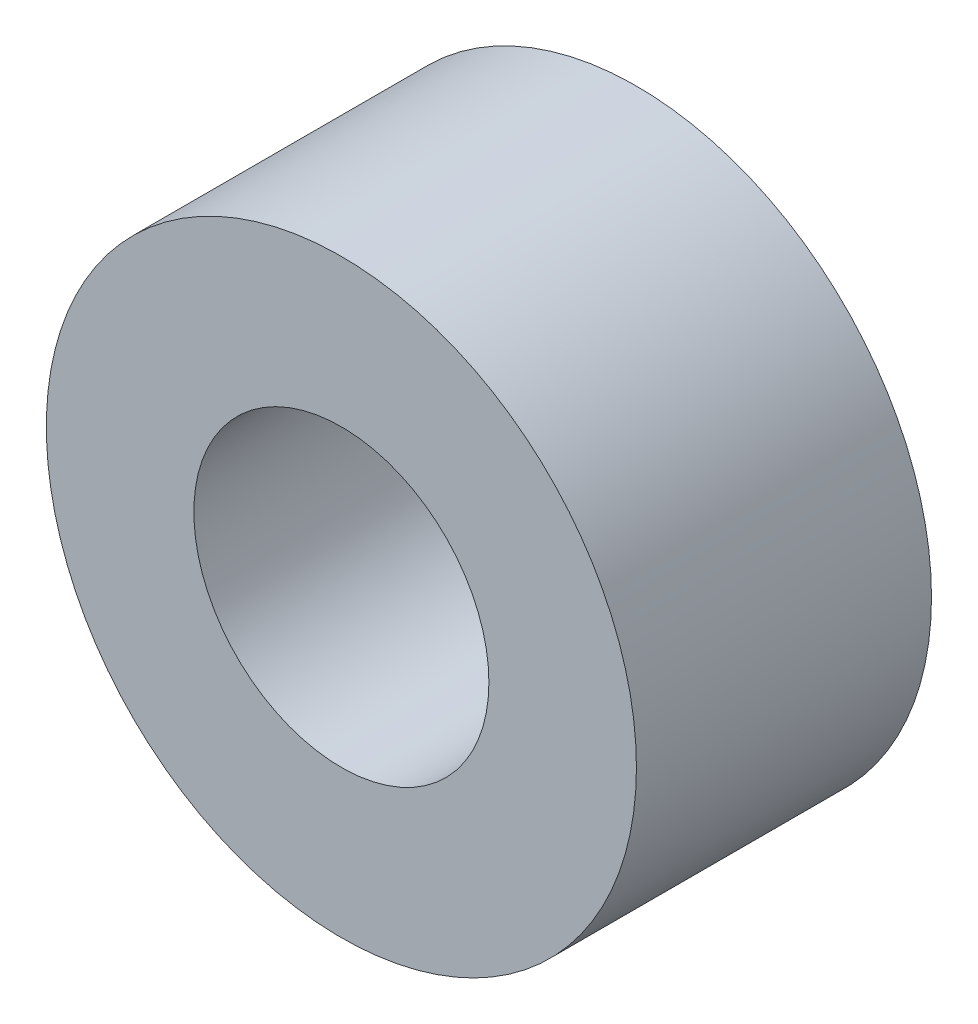
ISO-10303-21;
HEADER;
FILE_DESCRIPTION(('STEP AP214'),'2;1');
FILE_NAME('part.step','',(''),(''),'','','');
FILE_SCHEMA(('AUTOMOTIVE_DESIGN { 1 0 10303 214 1 1 1 1 }'));
ENDSEC;
DATA;
#1=APPLICATION_CONTEXT('core data for automotive mechanical design processes');
#2=APPLICATION_PROTOCOL_DEFINITION('international standard','automotive_design',2000,#1);
#3=PRODUCT_CONTEXT('',#1,'mechanical');
#4=PRODUCT('Part','Part','',(#3));
#5=PRODUCT_RELATED_PRODUCT_CATEGORY('part','',(#4));
#6=PRODUCT_DEFINITION_FORMATION('','',#4);
#7=PRODUCT_DEFINITION_CONTEXT('part definition',#1,'design');
#8=PRODUCT_DEFINITION('design','',#6,#7);
#9=PRODUCT_DEFINITION_SHAPE('','',#8);
#10=(LENGTH_UNIT() NAMED_UNIT(*) SI_UNIT(.MILLI.,.METRE.));
#11=(NAMED_UNIT(*) PLANE_ANGLE_UNIT() SI_UNIT($,.RADIAN.));
#12=(NAMED_UNIT(*) SI_UNIT($,.STERADIAN.) SOLID_ANGLE_UNIT());
#13=UNCERTAINTY_MEASURE_WITH_UNIT(LENGTH_MEASURE(1.E-05),#10,'distance_accuracy_value','');
#14=(GEOMETRIC_REPRESENTATION_CONTEXT(3) GLOBAL_UNCERTAINTY_ASSIGNED_CONTEXT((#13)) GLOBAL_UNIT_ASSIGNED_CONTEXT((#10,
#11,#12)) REPRESENTATION_CONTEXT('',''));
#15=CARTESIAN_POINT('',(0.,0.,0.));
#16=DIRECTION('',(0.,0.,1.));
#17=DIRECTION('',(1.,0.,0.));
#18=AXIS2_PLACEMENT_3D('',#15,#16,#17);
#19=CARTESIAN_POINT('',(-17.2957789322018,9.22906483344639,5.));
#20=DIRECTION('',(0.,0.,1.));
#21=DIRECTION('',(1.,0.,0.));
#22=AXIS2_PLACEMENT_3D('',#19,#20,#21);
#23=PLANE('',#22);
#24=CARTESIAN_POINT('',(-17.2957789322018,9.22906483344639,5.));
#25=DIRECTION('',(0.,0.,1.));
#26=DIRECTION('',(1.,0.,0.));
#27=AXIS2_PLACEMENT_3D('',#24,#25,#26);
#28=CIRCLE('',#27,5.);
#29=CARTESIAN_POINT('',(-12.2957789322018,9.22906483344639,5.));
#30=VERTEX_POINT('',#29);
#31=EDGE_CURVE('E10',#30,#30,#28,.T.);
#32=ORIENTED_EDGE('',*,*,#31,.T.);
#33=EDGE_LOOP('',(#32));
#34=FACE_BOUND('',#33,.T.);
#35=CARTESIAN_POINT('',(-17.2957789322018,9.22906483344639,5.));
#36=DIRECTION('',(0.,0.,1.));
#37=DIRECTION('',(1.,0.,0.));
#38=AXIS2_PLACEMENT_3D('',#35,#36,#37);
#39=CIRCLE('',#38,2.5);
#40=CARTESIAN_POINT('',(-14.7957789322018,9.22906483344639,5.));
#41=VERTEX_POINT('',#40);
#42=EDGE_CURVE('E42',#41,#41,#39,.T.);
#43=ORIENTED_EDGE('',*,*,#42,.F.);
#44=EDGE_LOOP('',(#43));
#45=FACE_BOUND('',#44,.T.);
#46=ADVANCED_FACE('F31',(#34,#45),#23,.T.);
#47=CARTESIAN_POINT('',(-17.2957789322018,9.22906483344639,0.));
#48=DIRECTION('',(0.,0.,1.));
#49=DIRECTION('',(1.,0.,0.));
#50=AXIS2_PLACEMENT_3D('',#47,#48,#49);
#51=PLANE('',#50);
#52=CARTESIAN_POINT('',(-17.2957789322018,9.22906483344639,0.));
#53=DIRECTION('',(0.,0.,1.));
#54=DIRECTION('',(1.,0.,0.));
#55=AXIS2_PLACEMENT_3D('',#52,#53,#54);
#56=CIRCLE('',#55,5.);
#57=CARTESIAN_POINT('',(-12.2957789322018,9.22906483344639,0.));
#58=VERTEX_POINT('',#57);
#59=EDGE_CURVE('E35',#58,#58,#56,.T.);
#60=ORIENTED_EDGE('',*,*,#59,.F.);
#61=EDGE_LOOP('',(#60));
#62=FACE_BOUND('',#61,.T.);
#63=CARTESIAN_POINT('',(-17.2957789322018,9.22906483344639,0.));
#64=DIRECTION('',(0.,0.,1.));
#65=DIRECTION('',(1.,0.,0.));
#66=AXIS2_PLACEMENT_3D('',#63,#64,#65);
#67=CIRCLE('',#66,2.5);
#68=CARTESIAN_POINT('',(-14.7957789322018,9.22906483344639,0.));
#69=VERTEX_POINT('',#68);
#70=EDGE_CURVE('E44',#69,#69,#67,.T.);
#71=ORIENTED_EDGE('',*,*,#70,.T.);
#72=EDGE_LOOP('',(#71));
#73=FACE_BOUND('',#72,.T.);
#74=ADVANCED_FACE('F54',(#62,#73),#51,.F.);
#75=CARTESIAN_POINT('',(-17.2957789322018,9.22906483344639,5.));
#76=DIRECTION('',(0.,0.,-1.));
#77=DIRECTION('',(-1.,0.,0.));
#78=AXIS2_PLACEMENT_3D('',#75,#76,#77);
#79=CYLINDRICAL_SURFACE('',#78,5.);
#80=ORIENTED_EDGE('',*,*,#31,.F.);
#81=EDGE_LOOP('',(#80));
#82=FACE_BOUND('',#81,.T.);
#83=ORIENTED_EDGE('',*,*,#59,.T.);
#84=EDGE_LOOP('',(#83));
#85=FACE_BOUND('',#84,.T.);
#86=ADVANCED_FACE('F33',(#82,#85),#79,.T.);
#87=CARTESIAN_POINT('',(-17.2957789322018,9.22906483344639,5.));
#88=DIRECTION('',(0.,0.,-1.));
#89=DIRECTION('',(-1.,0.,0.));
#90=AXIS2_PLACEMENT_3D('',#87,#88,#89);
#91=CYLINDRICAL_SURFACE('',#90,2.5);
#92=ORIENTED_EDGE('',*,*,#42,.T.);
#93=EDGE_LOOP('',(#92));
#94=FACE_BOUND('',#93,.T.);
#95=ORIENTED_EDGE('',*,*,#70,.F.);
#96=EDGE_LOOP('',(#95));
#97=FACE_BOUND('',#96,.T.);
#98=ADVANCED_FACE('F50',(#94,#97),#91,.F.);
#99=CLOSED_SHELL('',(#46,#74,#86,#98));
#100=MANIFOLD_SOLID_BREP('B2',#99);
#101=ADVANCED_BREP_SHAPE_REPRESENTATION('',(#18,#100),#14);
#102=SHAPE_DEFINITION_REPRESENTATION(#9,#101);
ENDSEC;
END-ISO-10303-21;
